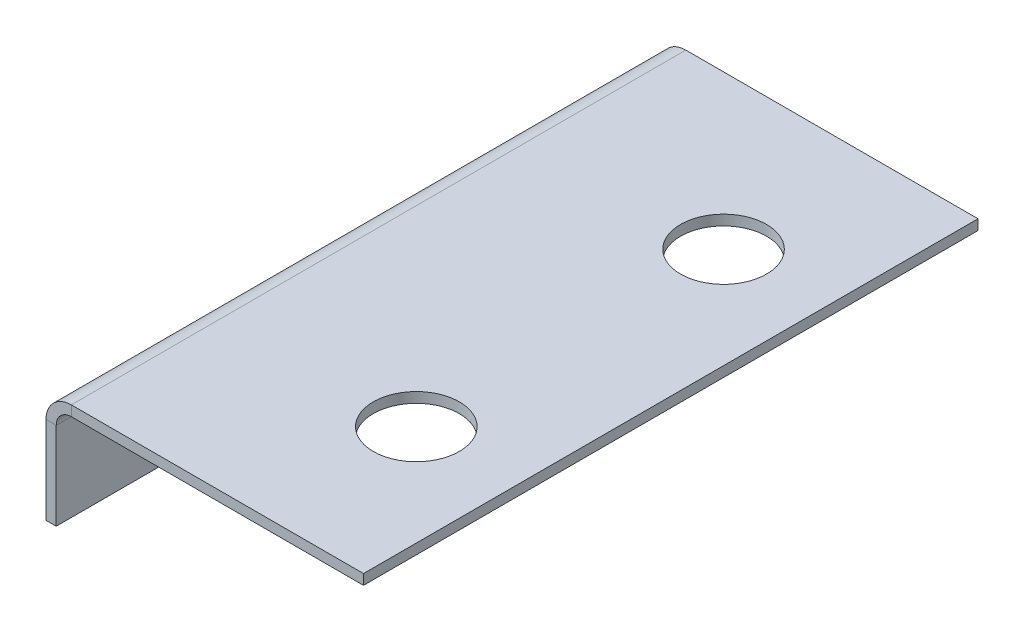
ISO-10303-21;
HEADER;
FILE_DESCRIPTION(('STEP AP214'),'2;1');
FILE_NAME('part.step','',(''),(''),'','','');
FILE_SCHEMA(('AUTOMOTIVE_DESIGN { 1 0 10303 214 1 1 1 1 }'));
ENDSEC;
DATA;
#1=APPLICATION_CONTEXT('core data for automotive mechanical design processes');
#2=APPLICATION_PROTOCOL_DEFINITION('international standard','automotive_design',2000,#1);
#3=PRODUCT_CONTEXT('',#1,'mechanical');
#4=PRODUCT('Part','Part','',(#3));
#5=PRODUCT_RELATED_PRODUCT_CATEGORY('part','',(#4));
#6=PRODUCT_DEFINITION_FORMATION('','',#4);
#7=PRODUCT_DEFINITION_CONTEXT('part definition',#1,'design');
#8=PRODUCT_DEFINITION('design','',#6,#7);
#9=PRODUCT_DEFINITION_SHAPE('','',#8);
#10=(LENGTH_UNIT() NAMED_UNIT(*) SI_UNIT(.MILLI.,.METRE.));
#11=(NAMED_UNIT(*) PLANE_ANGLE_UNIT() SI_UNIT($,.RADIAN.));
#12=(NAMED_UNIT(*) SI_UNIT($,.STERADIAN.) SOLID_ANGLE_UNIT());
#13=UNCERTAINTY_MEASURE_WITH_UNIT(LENGTH_MEASURE(1.E-05),#10,'distance_accuracy_value','');
#14=(GEOMETRIC_REPRESENTATION_CONTEXT(3) GLOBAL_UNCERTAINTY_ASSIGNED_CONTEXT((#13)) GLOBAL_UNIT_ASSIGNED_CONTEXT((#10,
#11,#12)) REPRESENTATION_CONTEXT('',''));
#15=CARTESIAN_POINT('',(0.,0.,0.));
#16=DIRECTION('',(0.,0.,1.));
#17=DIRECTION('',(1.,0.,0.));
#18=AXIS2_PLACEMENT_3D('',#15,#16,#17);
#19=CARTESIAN_POINT('',(2.98102416373977,-0.5,-16.8144264039461));
#20=DIRECTION('',(0.,0.,-1.));
#21=DIRECTION('',(-1.,0.,0.));
#22=AXIS2_PLACEMENT_3D('',#19,#20,#21);
#23=PLANE('',#22);
#24=DIRECTION('',(-1.,0.,0.));
#25=VECTOR('',#24,1.);
#26=CARTESIAN_POINT('',(2.98102416373977,-0.5,-16.8144264039461));
#27=LINE('',#26,#25);
#28=CARTESIAN_POINT('',(17.9810241637398,-0.5,-16.8144264039461));
#29=VERTEX_POINT('',#28);
#30=CARTESIAN_POINT('',(3.71762416373976,-0.500000000000003,-16.8144264039461));
#31=VERTEX_POINT('',#30);
#32=EDGE_CURVE('E93',#29,#31,#27,.T.);
#33=ORIENTED_EDGE('',*,*,#32,.T.);
#34=DIRECTION('',(0.,1.,0.));
#35=VECTOR('',#34,1.);
#36=CARTESIAN_POINT('',(3.71762416373976,-0.500000000000003,-16.8144264039461));
#37=LINE('',#36,#35);
#38=CARTESIAN_POINT('',(3.71762416373976,0.,-16.8144264039461));
#39=VERTEX_POINT('',#38);
#40=EDGE_CURVE('E86',#31,#39,#37,.T.);
#41=ORIENTED_EDGE('',*,*,#40,.T.);
#42=DIRECTION('',(-1.,0.,0.));
#43=VECTOR('',#42,1.);
#44=CARTESIAN_POINT('',(2.98102416373977,0.,-16.8144264039461));
#45=LINE('',#44,#43);
#46=CARTESIAN_POINT('',(17.9810241637398,0.,-16.8144264039461));
#47=VERTEX_POINT('',#46);
#48=EDGE_CURVE('E79',#47,#39,#45,.T.);
#49=ORIENTED_EDGE('',*,*,#48,.F.);
#50=DIRECTION('',(0.,1.,0.));
#51=VECTOR('',#50,1.);
#52=CARTESIAN_POINT('',(17.9810241637398,-0.5,-16.8144264039461));
#53=LINE('',#52,#51);
#54=EDGE_CURVE('E11',#29,#47,#53,.T.);
#55=ORIENTED_EDGE('',*,*,#54,.F.);
#56=EDGE_LOOP('',(#33,#41,#49,#55));
#57=FACE_BOUND('',#56,.T.);
#58=ADVANCED_FACE('F34',(#57),#23,.T.);
#59=CARTESIAN_POINT('',(0.,-0.5,0.));
#60=DIRECTION('',(0.,1.,0.));
#61=DIRECTION('',(0.,0.,1.));
#62=AXIS2_PLACEMENT_3D('',#59,#60,#61);
#63=PLANE('',#62);
#64=CARTESIAN_POINT('',(13.0587959706645,-0.5,5.68557359605393));
#65=DIRECTION('',(0.,1.,0.));
#66=DIRECTION('',(0.,0.,1.));
#67=AXIS2_PLACEMENT_3D('',#64,#65,#66);
#68=CIRCLE('',#67,2.1);
#69=CARTESIAN_POINT('',(13.0587959706645,-0.5,7.78557359605393));
#70=VERTEX_POINT('',#69);
#71=EDGE_CURVE('E92',#70,#70,#68,.T.);
#72=ORIENTED_EDGE('',*,*,#71,.T.);
#73=EDGE_LOOP('',(#72));
#74=FACE_BOUND('',#73,.T.);
#75=CARTESIAN_POINT('',(13.0587959706645,-0.5,-9.31442640394607));
#76=DIRECTION('',(0.,1.,0.));
#77=DIRECTION('',(0.,0.,1.));
#78=AXIS2_PLACEMENT_3D('',#75,#76,#77);
#79=CIRCLE('',#78,2.1);
#80=CARTESIAN_POINT('',(13.0587959706645,-0.5,-7.21442640394607));
#81=VERTEX_POINT('',#80);
#82=EDGE_CURVE('E99',#81,#81,#79,.T.);
#83=ORIENTED_EDGE('',*,*,#82,.T.);
#84=EDGE_LOOP('',(#83));
#85=FACE_BOUND('',#84,.T.);
#86=DIRECTION('',(0.,0.,-1.));
#87=VECTOR('',#86,1.);
#88=CARTESIAN_POINT('',(3.71762416373976,-0.500000000000003,-16.8144264039461));
#89=LINE('',#88,#87);
#90=CARTESIAN_POINT('',(3.71762416373976,-0.500000000000003,13.1855735960539));
#91=VERTEX_POINT('',#90);
#92=EDGE_CURVE('E113',#31,#91,#89,.F.);
#93=ORIENTED_EDGE('',*,*,#92,.F.);
#94=ORIENTED_EDGE('',*,*,#32,.F.);
#95=DIRECTION('',(0.,0.,-1.));
#96=VECTOR('',#95,1.);
#97=CARTESIAN_POINT('',(17.9810241637398,-0.5,-16.8144264039461));
#98=LINE('',#97,#96);
#99=CARTESIAN_POINT('',(17.9810241637398,-0.5,13.1855735960539));
#100=VERTEX_POINT('',#99);
#101=EDGE_CURVE('E73',#100,#29,#98,.T.);
#102=ORIENTED_EDGE('',*,*,#101,.F.);
#103=DIRECTION('',(1.,0.,0.));
#104=VECTOR('',#103,1.);
#105=CARTESIAN_POINT('',(2.98102416373977,-0.5,13.1855735960539));
#106=LINE('',#105,#104);
#107=EDGE_CURVE('E87',#91,#100,#106,.T.);
#108=ORIENTED_EDGE('',*,*,#107,.F.);
#109=EDGE_LOOP('',(#93,#94,#102,#108));
#110=FACE_BOUND('',#109,.T.);
#111=ADVANCED_FACE('F237',(#74,#85,#110),#63,.F.);
#112=CARTESIAN_POINT('',(0.,0.,0.));
#113=DIRECTION('',(0.,1.,0.));
#114=DIRECTION('',(0.,0.,1.));
#115=AXIS2_PLACEMENT_3D('',#112,#113,#114);
#116=PLANE('',#115);
#117=CARTESIAN_POINT('',(13.0587959706645,0.,5.68557359605393));
#118=DIRECTION('',(0.,1.,0.));
#119=DIRECTION('',(0.,0.,1.));
#120=AXIS2_PLACEMENT_3D('',#117,#118,#119);
#121=CIRCLE('',#120,2.1);
#122=CARTESIAN_POINT('',(13.0587959706645,0.,7.78557359605393));
#123=VERTEX_POINT('',#122);
#124=EDGE_CURVE('E96',#123,#123,#121,.T.);
#125=ORIENTED_EDGE('',*,*,#124,.F.);
#126=EDGE_LOOP('',(#125));
#127=FACE_BOUND('',#126,.T.);
#128=CARTESIAN_POINT('',(13.0587959706645,0.,-9.31442640394607));
#129=DIRECTION('',(0.,1.,0.));
#130=DIRECTION('',(0.,0.,1.));
#131=AXIS2_PLACEMENT_3D('',#128,#129,#130);
#132=CIRCLE('',#131,2.1);
#133=CARTESIAN_POINT('',(13.0587959706645,0.,-7.21442640394607));
#134=VERTEX_POINT('',#133);
#135=EDGE_CURVE('E102',#134,#134,#132,.T.);
#136=ORIENTED_EDGE('',*,*,#135,.F.);
#137=EDGE_LOOP('',(#136));
#138=FACE_BOUND('',#137,.T.);
#139=ORIENTED_EDGE('',*,*,#48,.T.);
#140=DIRECTION('',(0.,0.,-1.));
#141=VECTOR('',#140,1.);
#142=CARTESIAN_POINT('',(3.71762416373976,0.,-16.8144264039461));
#143=LINE('',#142,#141);
#144=CARTESIAN_POINT('',(3.71762416373976,0.,13.1855735960539));
#145=VERTEX_POINT('',#144);
#146=EDGE_CURVE('E123',#39,#145,#143,.F.);
#147=ORIENTED_EDGE('',*,*,#146,.T.);
#148=DIRECTION('',(1.,0.,0.));
#149=VECTOR('',#148,1.);
#150=CARTESIAN_POINT('',(2.98102416373977,0.,13.1855735960539));
#151=LINE('',#150,#149);
#152=CARTESIAN_POINT('',(17.9810241637398,0.,13.1855735960539));
#153=VERTEX_POINT('',#152);
#154=EDGE_CURVE('E81',#145,#153,#151,.T.);
#155=ORIENTED_EDGE('',*,*,#154,.T.);
#156=DIRECTION('',(0.,0.,-1.));
#157=VECTOR('',#156,1.);
#158=CARTESIAN_POINT('',(17.9810241637398,0.,-16.8144264039461));
#159=LINE('',#158,#157);
#160=EDGE_CURVE('E71',#153,#47,#159,.T.);
#161=ORIENTED_EDGE('',*,*,#160,.T.);
#162=EDGE_LOOP('',(#139,#147,#155,#161));
#163=FACE_BOUND('',#162,.T.);
#164=ADVANCED_FACE('F77',(#127,#138,#163),#116,.T.);
#165=CARTESIAN_POINT('',(17.9810241637398,-0.5,-16.8144264039461));
#166=DIRECTION('',(1.,0.,0.));
#167=DIRECTION('',(0.,0.,-1.));
#168=AXIS2_PLACEMENT_3D('',#165,#166,#167);
#169=PLANE('',#168);
#170=ORIENTED_EDGE('',*,*,#160,.F.);
#171=DIRECTION('',(0.,1.,0.));
#172=VECTOR('',#171,1.);
#173=CARTESIAN_POINT('',(17.9810241637398,-0.5,13.1855735960539));
#174=LINE('',#173,#172);
#175=EDGE_CURVE('E38',#100,#153,#174,.T.);
#176=ORIENTED_EDGE('',*,*,#175,.F.);
#177=ORIENTED_EDGE('',*,*,#101,.T.);
#178=ORIENTED_EDGE('',*,*,#54,.T.);
#179=EDGE_LOOP('',(#170,#176,#177,#178));
#180=FACE_BOUND('',#179,.T.);
#181=ADVANCED_FACE('F69',(#180),#169,.T.);
#182=CARTESIAN_POINT('',(2.98102416373977,-0.5,13.1855735960539));
#183=DIRECTION('',(0.,0.,1.));
#184=DIRECTION('',(1.,0.,0.));
#185=AXIS2_PLACEMENT_3D('',#182,#183,#184);
#186=PLANE('',#185);
#187=DIRECTION('',(0.,1.,0.));
#188=VECTOR('',#187,1.);
#189=CARTESIAN_POINT('',(3.71762416373976,-0.500000000000003,13.1855735960539));
#190=LINE('',#189,#188);
#191=EDGE_CURVE('E105',#91,#145,#190,.T.);
#192=ORIENTED_EDGE('',*,*,#191,.F.);
#193=ORIENTED_EDGE('',*,*,#107,.T.);
#194=ORIENTED_EDGE('',*,*,#175,.T.);
#195=ORIENTED_EDGE('',*,*,#154,.F.);
#196=EDGE_LOOP('',(#192,#193,#194,#195));
#197=FACE_BOUND('',#196,.T.);
#198=ADVANCED_FACE('F36',(#197),#186,.T.);
#199=CARTESIAN_POINT('',(13.0587959706645,-0.5,5.68557359605393));
#200=DIRECTION('',(0.,1.,0.));
#201=DIRECTION('',(0.,0.,1.));
#202=AXIS2_PLACEMENT_3D('',#199,#200,#201);
#203=CYLINDRICAL_SURFACE('',#202,2.1);
#204=ORIENTED_EDGE('',*,*,#71,.F.);
#205=EDGE_LOOP('',(#204));
#206=FACE_BOUND('',#205,.T.);
#207=ORIENTED_EDGE('',*,*,#124,.T.);
#208=EDGE_LOOP('',(#207));
#209=FACE_BOUND('',#208,.T.);
#210=ADVANCED_FACE('F250',(#206,#209),#203,.F.);
#211=CARTESIAN_POINT('',(13.0587959706645,-0.5,-9.31442640394607));
#212=DIRECTION('',(0.,1.,0.));
#213=DIRECTION('',(0.,0.,1.));
#214=AXIS2_PLACEMENT_3D('',#211,#212,#213);
#215=CYLINDRICAL_SURFACE('',#214,2.1);
#216=ORIENTED_EDGE('',*,*,#82,.F.);
#217=EDGE_LOOP('',(#216));
#218=FACE_BOUND('',#217,.T.);
#219=ORIENTED_EDGE('',*,*,#135,.T.);
#220=EDGE_LOOP('',(#219));
#221=FACE_BOUND('',#220,.T.);
#222=ADVANCED_FACE('F259',(#218,#221),#215,.F.);
#223=CARTESIAN_POINT('',(3.71762416373977,-1.2366,13.1855735960539));
#224=DIRECTION('',(0.,0.,1.));
#225=DIRECTION('',(1.,0.,0.));
#226=AXIS2_PLACEMENT_3D('',#223,#224,#225);
#227=PLANE('',#226);
#228=DIRECTION('',(-1.,0.,0.));
#229=VECTOR('',#228,1.);
#230=CARTESIAN_POINT('',(2.98102416373977,-1.2366,13.1855735960539));
#231=LINE('',#230,#229);
#232=CARTESIAN_POINT('',(2.98102416373977,-1.2366,13.1855735960539));
#233=VERTEX_POINT('',#232);
#234=CARTESIAN_POINT('',(2.48102416373977,-1.2366,13.1855735960539));
#235=VERTEX_POINT('',#234);
#236=EDGE_CURVE('E152',#233,#235,#231,.T.);
#237=ORIENTED_EDGE('',*,*,#236,.F.);
#238=CARTESIAN_POINT('',(3.71762416373977,-1.2366,13.1855735960539));
#239=DIRECTION('',(0.,0.,-1.));
#240=DIRECTION('',(-1.,0.,0.));
#241=AXIS2_PLACEMENT_3D('',#238,#239,#240);
#242=CIRCLE('',#241,0.736599999999997);
#243=EDGE_CURVE('E117',#91,#233,#242,.F.);
#244=ORIENTED_EDGE('',*,*,#243,.F.);
#245=ORIENTED_EDGE('',*,*,#191,.T.);
#246=CARTESIAN_POINT('',(3.71762416373977,-1.2366,13.1855735960539));
#247=DIRECTION('',(0.,0.,-1.));
#248=DIRECTION('',(-1.,0.,0.));
#249=AXIS2_PLACEMENT_3D('',#246,#247,#248);
#250=CIRCLE('',#249,1.2366);
#251=EDGE_CURVE('E49',#145,#235,#250,.F.);
#252=ORIENTED_EDGE('',*,*,#251,.T.);
#253=EDGE_LOOP('',(#237,#244,#245,#252));
#254=FACE_BOUND('',#253,.T.);
#255=ADVANCED_FACE('F261',(#254),#227,.T.);
#256=CARTESIAN_POINT('',(3.71762416373977,-1.2366,-16.8144264039461));
#257=DIRECTION('',(0.,0.,1.));
#258=DIRECTION('',(1.,0.,0.));
#259=AXIS2_PLACEMENT_3D('',#256,#257,#258);
#260=PLANE('',#259);
#261=CARTESIAN_POINT('',(3.71762416373977,-1.2366,-16.8144264039461));
#262=DIRECTION('',(0.,0.,-1.));
#263=DIRECTION('',(-1.,0.,0.));
#264=AXIS2_PLACEMENT_3D('',#261,#262,#263);
#265=CIRCLE('',#264,0.736599999999997);
#266=CARTESIAN_POINT('',(2.98102416373977,-1.2366,-16.8144264039461));
#267=VERTEX_POINT('',#266);
#268=EDGE_CURVE('E110',#267,#31,#265,.T.);
#269=ORIENTED_EDGE('',*,*,#268,.F.);
#270=DIRECTION('',(-1.,0.,0.));
#271=VECTOR('',#270,1.);
#272=CARTESIAN_POINT('',(2.98102416373976,-1.2366,-16.8144264039461));
#273=LINE('',#272,#271);
#274=CARTESIAN_POINT('',(2.48102416373977,-1.2366,-16.8144264039461));
#275=VERTEX_POINT('',#274);
#276=EDGE_CURVE('E151',#267,#275,#273,.T.);
#277=ORIENTED_EDGE('',*,*,#276,.T.);
#278=CARTESIAN_POINT('',(3.71762416373977,-1.2366,-16.8144264039461));
#279=DIRECTION('',(0.,0.,-1.));
#280=DIRECTION('',(-1.,0.,0.));
#281=AXIS2_PLACEMENT_3D('',#278,#279,#280);
#282=CIRCLE('',#281,1.2366);
#283=EDGE_CURVE('E120',#275,#39,#282,.T.);
#284=ORIENTED_EDGE('',*,*,#283,.T.);
#285=ORIENTED_EDGE('',*,*,#40,.F.);
#286=EDGE_LOOP('',(#269,#277,#284,#285));
#287=FACE_BOUND('',#286,.T.);
#288=ADVANCED_FACE('F268',(#287),#260,.F.);
#289=CARTESIAN_POINT('',(3.71762416373977,-1.2366,-16.8144264039461));
#290=DIRECTION('',(0.,0.,-1.));
#291=DIRECTION('',(-1.,0.,0.));
#292=AXIS2_PLACEMENT_3D('',#289,#290,#291);
#293=CYLINDRICAL_SURFACE('',#292,1.2366);
#294=ORIENTED_EDGE('',*,*,#146,.F.);
#295=ORIENTED_EDGE('',*,*,#283,.F.);
#296=DIRECTION('',(0.,0.,1.));
#297=VECTOR('',#296,1.);
#298=CARTESIAN_POINT('',(2.48102416373977,-1.2366,0.));
#299=LINE('',#298,#297);
#300=EDGE_CURVE('E142',#275,#235,#299,.T.);
#301=ORIENTED_EDGE('',*,*,#300,.T.);
#302=ORIENTED_EDGE('',*,*,#251,.F.);
#303=EDGE_LOOP('',(#294,#295,#301,#302));
#304=FACE_BOUND('',#303,.T.);
#305=ADVANCED_FACE('F275',(#304),#293,.T.);
#306=CARTESIAN_POINT('',(3.71762416373977,-1.2366,-16.8144264039461));
#307=DIRECTION('',(0.,0.,-1.));
#308=DIRECTION('',(-1.,0.,0.));
#309=AXIS2_PLACEMENT_3D('',#306,#307,#308);
#310=CYLINDRICAL_SURFACE('',#309,0.736599999999997);
#311=ORIENTED_EDGE('',*,*,#92,.T.);
#312=ORIENTED_EDGE('',*,*,#243,.T.);
#313=DIRECTION('',(0.,0.,-1.));
#314=VECTOR('',#313,1.);
#315=CARTESIAN_POINT('',(2.98102416373977,-1.2366,13.1855735960539));
#316=LINE('',#315,#314);
#317=EDGE_CURVE('E155',#233,#267,#316,.T.);
#318=ORIENTED_EDGE('',*,*,#317,.T.);
#319=ORIENTED_EDGE('',*,*,#268,.T.);
#320=EDGE_LOOP('',(#311,#312,#318,#319));
#321=FACE_BOUND('',#320,.T.);
#322=ADVANCED_FACE('F233',(#321),#310,.F.);
#323=CARTESIAN_POINT('',(2.48102416373975,-5.5,-16.8144264039461));
#324=DIRECTION('',(0.,0.,1.));
#325=DIRECTION('',(1.,0.,0.));
#326=AXIS2_PLACEMENT_3D('',#323,#324,#325);
#327=PLANE('',#326);
#328=ORIENTED_EDGE('',*,*,#276,.F.);
#329=DIRECTION('',(0.,-1.,0.));
#330=VECTOR('',#329,1.);
#331=CARTESIAN_POINT('',(2.98102416373975,-5.5,-16.8144264039461));
#332=LINE('',#331,#330);
#333=CARTESIAN_POINT('',(2.98102416373975,-5.5,-16.8144264039461));
#334=VERTEX_POINT('',#333);
#335=EDGE_CURVE('E139',#267,#334,#332,.T.);
#336=ORIENTED_EDGE('',*,*,#335,.T.);
#337=DIRECTION('',(1.,0.,0.));
#338=VECTOR('',#337,1.);
#339=CARTESIAN_POINT('',(2.48102416373975,-5.5,-16.8144264039461));
#340=LINE('',#339,#338);
#341=CARTESIAN_POINT('',(2.48102416373975,-5.5,-16.8144264039461));
#342=VERTEX_POINT('',#341);
#343=EDGE_CURVE('E114',#342,#334,#340,.T.);
#344=ORIENTED_EDGE('',*,*,#343,.F.);
#345=DIRECTION('',(0.,-1.,0.));
#346=VECTOR('',#345,1.);
#347=CARTESIAN_POINT('',(2.48102416373975,-5.5,-16.8144264039461));
#348=LINE('',#347,#346);
#349=EDGE_CURVE('E135',#275,#342,#348,.T.);
#350=ORIENTED_EDGE('',*,*,#349,.F.);
#351=EDGE_LOOP('',(#328,#336,#344,#350));
#352=FACE_BOUND('',#351,.T.);
#353=ADVANCED_FACE('F195',(#352),#327,.F.);
#354=CARTESIAN_POINT('',(2.48102416373977,-0.499999999999998,13.1855735960539));
#355=DIRECTION('',(0.,0.,-1.));
#356=DIRECTION('',(-1.,0.,0.));
#357=AXIS2_PLACEMENT_3D('',#354,#355,#356);
#358=PLANE('',#357);
#359=ORIENTED_EDGE('',*,*,#236,.T.);
#360=DIRECTION('',(0.,1.,0.));
#361=VECTOR('',#360,1.);
#362=CARTESIAN_POINT('',(2.48102416373977,-0.499999999999998,13.1855735960539));
#363=LINE('',#362,#361);
#364=CARTESIAN_POINT('',(2.48102416373975,-5.5,13.1855735960539));
#365=VERTEX_POINT('',#364);
#366=EDGE_CURVE('E131',#365,#235,#363,.T.);
#367=ORIENTED_EDGE('',*,*,#366,.F.);
#368=DIRECTION('',(1.,0.,0.));
#369=VECTOR('',#368,1.);
#370=CARTESIAN_POINT('',(2.48102416373975,-5.5,13.1855735960539));
#371=LINE('',#370,#369);
#372=CARTESIAN_POINT('',(2.98102416373975,-5.5,13.1855735960539));
#373=VERTEX_POINT('',#372);
#374=EDGE_CURVE('E128',#365,#373,#371,.T.);
#375=ORIENTED_EDGE('',*,*,#374,.T.);
#376=DIRECTION('',(0.,1.,0.));
#377=VECTOR('',#376,1.);
#378=CARTESIAN_POINT('',(2.98102416373977,-0.5,13.1855735960539));
#379=LINE('',#378,#377);
#380=EDGE_CURVE('E132',#373,#233,#379,.T.);
#381=ORIENTED_EDGE('',*,*,#380,.T.);
#382=EDGE_LOOP('',(#359,#367,#375,#381));
#383=FACE_BOUND('',#382,.T.);
#384=ADVANCED_FACE('F224',(#383),#358,.F.);
#385=CARTESIAN_POINT('',(2.48102416373977,0.,0.));
#386=DIRECTION('',(1.,0.,0.));
#387=DIRECTION('',(0.,1.,0.));
#388=AXIS2_PLACEMENT_3D('',#385,#386,#387);
#389=PLANE('',#388);
#390=CARTESIAN_POINT('',(2.48102416373976,-3.5,1.48557359605393));
#391=DIRECTION('',(1.,0.,0.));
#392=DIRECTION('',(0.,1.,0.));
#393=AXIS2_PLACEMENT_3D('',#390,#391,#392);
#394=CIRCLE('',#393,1.1);
#395=CARTESIAN_POINT('',(2.48102416373976,-2.4,1.48557359605393));
#396=VERTEX_POINT('',#395);
#397=EDGE_CURVE('E166',#396,#396,#394,.T.);
#398=ORIENTED_EDGE('',*,*,#397,.T.);
#399=EDGE_LOOP('',(#398));
#400=FACE_BOUND('',#399,.T.);
#401=CARTESIAN_POINT('',(2.48102416373976,-3.5,-5.11442640394607));
#402=DIRECTION('',(1.,0.,0.));
#403=DIRECTION('',(0.,1.,0.));
#404=AXIS2_PLACEMENT_3D('',#401,#402,#403);
#405=CIRCLE('',#404,1.1);
#406=CARTESIAN_POINT('',(2.48102416373976,-2.4,-5.11442640394607));
#407=VERTEX_POINT('',#406);
#408=EDGE_CURVE('E156',#407,#407,#405,.T.);
#409=ORIENTED_EDGE('',*,*,#408,.T.);
#410=EDGE_LOOP('',(#409));
#411=FACE_BOUND('',#410,.T.);
#412=ORIENTED_EDGE('',*,*,#300,.F.);
#413=ORIENTED_EDGE('',*,*,#349,.T.);
#414=DIRECTION('',(0.,0.,1.));
#415=VECTOR('',#414,1.);
#416=CARTESIAN_POINT('',(2.48102416373975,-5.5,13.1855735960539));
#417=LINE('',#416,#415);
#418=EDGE_CURVE('E145',#342,#365,#417,.T.);
#419=ORIENTED_EDGE('',*,*,#418,.T.);
#420=ORIENTED_EDGE('',*,*,#366,.T.);
#421=EDGE_LOOP('',(#412,#413,#419,#420));
#422=FACE_BOUND('',#421,.T.);
#423=ADVANCED_FACE('F180',(#400,#411,#422),#389,.F.);
#424=CARTESIAN_POINT('',(2.98102416373977,0.,0.));
#425=DIRECTION('',(1.,0.,0.));
#426=DIRECTION('',(0.,1.,0.));
#427=AXIS2_PLACEMENT_3D('',#424,#425,#426);
#428=PLANE('',#427);
#429=CARTESIAN_POINT('',(2.98102416373976,-3.5,1.48557359605393));
#430=DIRECTION('',(1.,0.,0.));
#431=DIRECTION('',(0.,1.,0.));
#432=AXIS2_PLACEMENT_3D('',#429,#430,#431);
#433=CIRCLE('',#432,1.1);
#434=CARTESIAN_POINT('',(2.98102416373976,-2.4,1.48557359605393));
#435=VERTEX_POINT('',#434);
#436=EDGE_CURVE('E169',#435,#435,#433,.T.);
#437=ORIENTED_EDGE('',*,*,#436,.F.);
#438=EDGE_LOOP('',(#437));
#439=FACE_BOUND('',#438,.T.);
#440=CARTESIAN_POINT('',(2.98102416373976,-3.5,-5.11442640394607));
#441=DIRECTION('',(1.,0.,0.));
#442=DIRECTION('',(0.,1.,0.));
#443=AXIS2_PLACEMENT_3D('',#440,#441,#442);
#444=CIRCLE('',#443,1.1);
#445=CARTESIAN_POINT('',(2.98102416373976,-2.4,-5.11442640394607));
#446=VERTEX_POINT('',#445);
#447=EDGE_CURVE('E163',#446,#446,#444,.T.);
#448=ORIENTED_EDGE('',*,*,#447,.F.);
#449=EDGE_LOOP('',(#448));
#450=FACE_BOUND('',#449,.T.);
#451=ORIENTED_EDGE('',*,*,#335,.F.);
#452=ORIENTED_EDGE('',*,*,#317,.F.);
#453=ORIENTED_EDGE('',*,*,#380,.F.);
#454=DIRECTION('',(0.,0.,1.));
#455=VECTOR('',#454,1.);
#456=CARTESIAN_POINT('',(2.98102416373975,-5.5,13.1855735960539));
#457=LINE('',#456,#455);
#458=EDGE_CURVE('E136',#334,#373,#457,.T.);
#459=ORIENTED_EDGE('',*,*,#458,.F.);
#460=EDGE_LOOP('',(#451,#452,#453,#459));
#461=FACE_BOUND('',#460,.T.);
#462=ADVANCED_FACE('F176',(#439,#450,#461),#428,.T.);
#463=CARTESIAN_POINT('',(2.48102416373975,-5.5,13.1855735960539));
#464=DIRECTION('',(0.,1.,0.));
#465=DIRECTION('',(-1.,0.,0.));
#466=AXIS2_PLACEMENT_3D('',#463,#464,#465);
#467=PLANE('',#466);
#468=ORIENTED_EDGE('',*,*,#458,.T.);
#469=ORIENTED_EDGE('',*,*,#374,.F.);
#470=ORIENTED_EDGE('',*,*,#418,.F.);
#471=ORIENTED_EDGE('',*,*,#343,.T.);
#472=EDGE_LOOP('',(#468,#469,#470,#471));
#473=FACE_BOUND('',#472,.T.);
#474=ADVANCED_FACE('F179',(#473),#467,.F.);
#475=CARTESIAN_POINT('',(-7.01897583626024,-3.49999999999996,-5.11442640394607));
#476=DIRECTION('',(1.,0.,0.));
#477=DIRECTION('',(0.,1.,0.));
#478=AXIS2_PLACEMENT_3D('',#475,#476,#477);
#479=CYLINDRICAL_SURFACE('',#478,1.1);
#480=ORIENTED_EDGE('',*,*,#447,.T.);
#481=EDGE_LOOP('',(#480));
#482=FACE_BOUND('',#481,.T.);
#483=ORIENTED_EDGE('',*,*,#408,.F.);
#484=EDGE_LOOP('',(#483));
#485=FACE_BOUND('',#484,.T.);
#486=ADVANCED_FACE('F283',(#482,#485),#479,.F.);
#487=CARTESIAN_POINT('',(-7.01897583626024,-3.49999999999996,1.48557359605393));
#488=DIRECTION('',(1.,0.,0.));
#489=DIRECTION('',(0.,1.,0.));
#490=AXIS2_PLACEMENT_3D('',#487,#488,#489);
#491=CYLINDRICAL_SURFACE('',#490,1.1);
#492=ORIENTED_EDGE('',*,*,#436,.T.);
#493=EDGE_LOOP('',(#492));
#494=FACE_BOUND('',#493,.T.);
#495=ORIENTED_EDGE('',*,*,#397,.F.);
#496=EDGE_LOOP('',(#495));
#497=FACE_BOUND('',#496,.T.);
#498=ADVANCED_FACE('F173',(#494,#497),#491,.F.);
#499=CLOSED_SHELL('',(#58,#111,#164,#181,#198,#210,#222,#255,#288,#305,#322,#353,#384,#423,#462,
#474,#486,#498));
#500=MANIFOLD_SOLID_BREP('B2',#499);
#501=ADVANCED_BREP_SHAPE_REPRESENTATION('',(#18,#500),#14);
#502=SHAPE_DEFINITION_REPRESENTATION(#9,#501);
ENDSEC;
END-ISO-10303-21;
